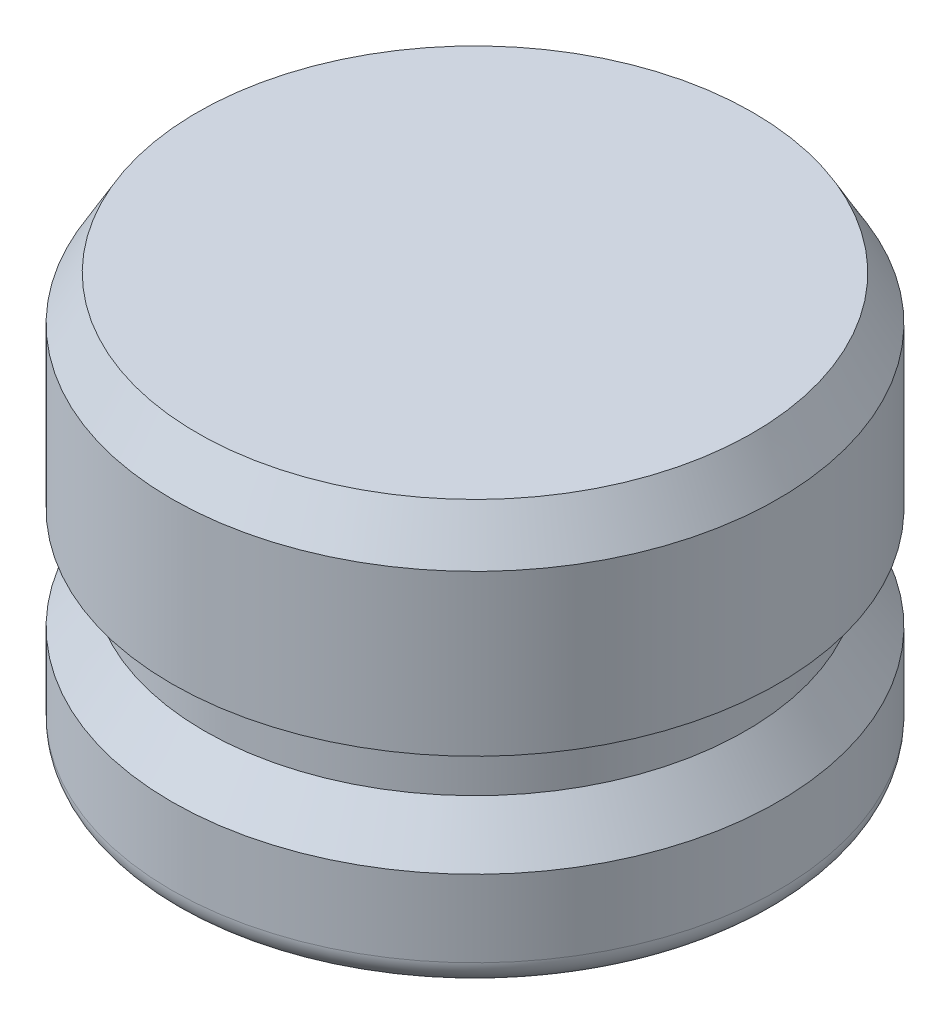
ISO-10303-21;
HEADER;
FILE_DESCRIPTION(('STEP AP214'),'2;1');
FILE_NAME('part.step','',(''),(''),'','','');
FILE_SCHEMA(('AUTOMOTIVE_DESIGN { 1 0 10303 214 1 1 1 1 }'));
ENDSEC;
DATA;
#1=APPLICATION_CONTEXT('core data for automotive mechanical design processes');
#2=APPLICATION_PROTOCOL_DEFINITION('international standard','automotive_design',2000,#1);
#3=PRODUCT_CONTEXT('',#1,'mechanical');
#4=PRODUCT('Part','Part','',(#3));
#5=PRODUCT_RELATED_PRODUCT_CATEGORY('part','',(#4));
#6=PRODUCT_DEFINITION_FORMATION('','',#4);
#7=PRODUCT_DEFINITION_CONTEXT('part definition',#1,'design');
#8=PRODUCT_DEFINITION('design','',#6,#7);
#9=PRODUCT_DEFINITION_SHAPE('','',#8);
#10=(LENGTH_UNIT() NAMED_UNIT(*) SI_UNIT(.MILLI.,.METRE.));
#11=(NAMED_UNIT(*) PLANE_ANGLE_UNIT() SI_UNIT($,.RADIAN.));
#12=(NAMED_UNIT(*) SI_UNIT($,.STERADIAN.) SOLID_ANGLE_UNIT());
#13=UNCERTAINTY_MEASURE_WITH_UNIT(LENGTH_MEASURE(1.E-05),#10,'distance_accuracy_value','');
#14=(GEOMETRIC_REPRESENTATION_CONTEXT(3) GLOBAL_UNCERTAINTY_ASSIGNED_CONTEXT((#13)) GLOBAL_UNIT_ASSIGNED_CONTEXT((#10,
#11,#12)) REPRESENTATION_CONTEXT('',''));
#15=CARTESIAN_POINT('',(0.,0.,0.));
#16=DIRECTION('',(0.,0.,1.));
#17=DIRECTION('',(1.,0.,0.));
#18=AXIS2_PLACEMENT_3D('',#15,#16,#17);
#19=CARTESIAN_POINT('',(0.,0.,0.));
#20=DIRECTION('',(0.,1.,0.));
#21=DIRECTION('',(0.,0.,1.));
#22=AXIS2_PLACEMENT_3D('',#19,#20,#21);
#23=PLANE('',#22);
#24=CARTESIAN_POINT('',(0.,0.,0.));
#25=DIRECTION('',(0.,1.,0.));
#26=DIRECTION('',(0.,0.,1.));
#27=AXIS2_PLACEMENT_3D('',#24,#25,#26);
#28=CIRCLE('',#27,8.62965);
#29=CARTESIAN_POINT('',(0.,0.,8.62965));
#30=VERTEX_POINT('',#29);
#31=EDGE_CURVE('E46',#30,#30,#28,.F.);
#32=ORIENTED_EDGE('',*,*,#31,.T.);
#33=EDGE_LOOP('',(#32));
#34=FACE_BOUND('',#33,.T.);
#35=ADVANCED_FACE('F31',(#34),#23,.F.);
#36=CARTESIAN_POINT('',(0.,0.,0.));
#37=DIRECTION('',(0.,-1.,0.));
#38=DIRECTION('',(0.,0.,-1.));
#39=AXIS2_PLACEMENT_3D('',#36,#37,#38);
#40=CYLINDRICAL_SURFACE('',#39,9.4234);
#41=CARTESIAN_POINT('',(0.,0.793749999999999,0.));
#42=DIRECTION('',(0.,1.,0.));
#43=DIRECTION('',(0.,0.,1.));
#44=AXIS2_PLACEMENT_3D('',#41,#42,#43);
#45=CIRCLE('',#44,9.4234);
#46=CARTESIAN_POINT('',(0.,0.793749999999999,9.4234));
#47=VERTEX_POINT('',#46);
#48=EDGE_CURVE('E42',#47,#47,#45,.T.);
#49=ORIENTED_EDGE('',*,*,#48,.T.);
#50=EDGE_LOOP('',(#49));
#51=FACE_BOUND('',#50,.T.);
#52=CARTESIAN_POINT('',(0.,3.175,0.));
#53=DIRECTION('',(0.,-1.,0.));
#54=DIRECTION('',(0.,0.,-1.));
#55=AXIS2_PLACEMENT_3D('',#52,#53,#54);
#56=CIRCLE('',#55,9.4234);
#57=CARTESIAN_POINT('',(0.,3.175,-9.4234));
#58=VERTEX_POINT('',#57);
#59=EDGE_CURVE('E51',#58,#58,#56,.T.);
#60=ORIENTED_EDGE('',*,*,#59,.T.);
#61=EDGE_LOOP('',(#60));
#62=FACE_BOUND('',#61,.T.);
#63=ADVANCED_FACE('F80',(#51,#62),#40,.T.);
#64=CARTESIAN_POINT('',(0.,4.572,0.));
#65=DIRECTION('',(0.,-1.,0.));
#66=DIRECTION('',(0.,0.,-1.));
#67=AXIS2_PLACEMENT_3D('',#64,#65,#66);
#68=CONICAL_SURFACE('',#67,8.4074,0.628796286415433);
#69=ORIENTED_EDGE('',*,*,#59,.F.);
#70=EDGE_LOOP('',(#69));
#71=FACE_BOUND('',#70,.T.);
#72=CARTESIAN_POINT('',(0.,4.572,0.));
#73=DIRECTION('',(0.,-1.,0.));
#74=DIRECTION('',(0.,0.,-1.));
#75=AXIS2_PLACEMENT_3D('',#72,#73,#74);
#76=CIRCLE('',#75,8.4074);
#77=CARTESIAN_POINT('',(0.,4.572,-8.4074));
#78=VERTEX_POINT('',#77);
#79=EDGE_CURVE('E54',#78,#78,#76,.T.);
#80=ORIENTED_EDGE('',*,*,#79,.T.);
#81=EDGE_LOOP('',(#80));
#82=FACE_BOUND('',#81,.T.);
#83=ADVANCED_FACE('F86',(#71,#82),#68,.T.);
#84=CARTESIAN_POINT('',(0.,0.,0.));
#85=DIRECTION('',(0.,-1.,0.));
#86=DIRECTION('',(0.,0.,-1.));
#87=AXIS2_PLACEMENT_3D('',#84,#85,#86);
#88=CYLINDRICAL_SURFACE('',#87,8.4074);
#89=ORIENTED_EDGE('',*,*,#79,.F.);
#90=EDGE_LOOP('',(#89));
#91=FACE_BOUND('',#90,.T.);
#92=CARTESIAN_POINT('',(0.,6.35,0.));
#93=DIRECTION('',(0.,-1.,0.));
#94=DIRECTION('',(0.,0.,-1.));
#95=AXIS2_PLACEMENT_3D('',#92,#93,#94);
#96=CIRCLE('',#95,8.4074);
#97=CARTESIAN_POINT('',(0.,6.35,-8.4074));
#98=VERTEX_POINT('',#97);
#99=EDGE_CURVE('E57',#98,#98,#96,.T.);
#100=ORIENTED_EDGE('',*,*,#99,.T.);
#101=EDGE_LOOP('',(#100));
#102=FACE_BOUND('',#101,.T.);
#103=ADVANCED_FACE('F76',(#91,#102),#88,.T.);
#104=CARTESIAN_POINT('',(-8.4074,6.35,0.));
#105=DIRECTION('',(0.,1.,0.));
#106=DIRECTION('',(0.,0.,1.));
#107=AXIS2_PLACEMENT_3D('',#104,#105,#106);
#108=PLANE('',#107);
#109=ORIENTED_EDGE('',*,*,#99,.F.);
#110=EDGE_LOOP('',(#109));
#111=FACE_BOUND('',#110,.T.);
#112=CARTESIAN_POINT('',(0.,6.35,0.));
#113=DIRECTION('',(0.,-1.,0.));
#114=DIRECTION('',(0.,0.,-1.));
#115=AXIS2_PLACEMENT_3D('',#112,#113,#114);
#116=CIRCLE('',#115,9.4234);
#117=CARTESIAN_POINT('',(0.,6.35,-9.4234));
#118=VERTEX_POINT('',#117);
#119=EDGE_CURVE('E60',#118,#118,#116,.T.);
#120=ORIENTED_EDGE('',*,*,#119,.T.);
#121=EDGE_LOOP('',(#120));
#122=FACE_BOUND('',#121,.T.);
#123=ADVANCED_FACE('F64',(#111,#122),#108,.F.);
#124=CARTESIAN_POINT('',(0.,0.,0.));
#125=DIRECTION('',(0.,-1.,0.));
#126=DIRECTION('',(0.,0.,-1.));
#127=AXIS2_PLACEMENT_3D('',#124,#125,#126);
#128=CYLINDRICAL_SURFACE('',#127,9.4234);
#129=CARTESIAN_POINT('',(0.,11.3251846714922,0.));
#130=DIRECTION('',(0.,-1.,0.));
#131=DIRECTION('',(0.,0.,-1.));
#132=AXIS2_PLACEMENT_3D('',#129,#130,#131);
#133=CIRCLE('',#132,9.4234);
#134=CARTESIAN_POINT('',(0.,11.3251846714922,-9.4234));
#135=VERTEX_POINT('',#134);
#136=EDGE_CURVE('E38',#135,#135,#133,.T.);
#137=ORIENTED_EDGE('',*,*,#136,.T.);
#138=EDGE_LOOP('',(#137));
#139=FACE_BOUND('',#138,.T.);
#140=ORIENTED_EDGE('',*,*,#119,.F.);
#141=EDGE_LOOP('',(#140));
#142=FACE_BOUND('',#141,.T.);
#143=ADVANCED_FACE('F66',(#139,#142),#128,.T.);
#144=CARTESIAN_POINT('',(-9.4234,12.7,0.));
#145=DIRECTION('',(0.,-1.,0.));
#146=DIRECTION('',(0.,0.,-1.));
#147=AXIS2_PLACEMENT_3D('',#144,#145,#146);
#148=PLANE('',#147);
#149=CARTESIAN_POINT('',(0.,12.7,0.));
#150=DIRECTION('',(0.,-1.,0.));
#151=DIRECTION('',(0.,0.,-1.));
#152=AXIS2_PLACEMENT_3D('',#149,#150,#151);
#153=CIRCLE('',#152,8.62965);
#154=CARTESIAN_POINT('',(0.,12.7,-8.62965));
#155=VERTEX_POINT('',#154);
#156=EDGE_CURVE('E10',#155,#155,#153,.F.);
#157=ORIENTED_EDGE('',*,*,#156,.T.);
#158=EDGE_LOOP('',(#157));
#159=FACE_BOUND('',#158,.T.);
#160=ADVANCED_FACE('F68',(#159),#148,.F.);
#161=CARTESIAN_POINT('',(0.,0.793749999999999,0.));
#162=DIRECTION('',(0.,1.,0.));
#163=DIRECTION('',(0.,0.,1.));
#164=AXIS2_PLACEMENT_3D('',#161,#162,#163);
#165=TOROIDAL_SURFACE('',#164,8.62965,0.79375);
#166=ORIENTED_EDGE('',*,*,#48,.F.);
#167=EDGE_LOOP('',(#166));
#168=FACE_BOUND('',#167,.T.);
#169=ORIENTED_EDGE('',*,*,#31,.F.);
#170=EDGE_LOOP('',(#169));
#171=FACE_BOUND('',#170,.T.);
#172=ADVANCED_FACE('F74',(#168,#171),#165,.T.);
#173=CARTESIAN_POINT('',(0.,11.3251846714922,0.));
#174=DIRECTION('',(0.,-1.,0.));
#175=DIRECTION('',(0.,0.,-1.));
#176=AXIS2_PLACEMENT_3D('',#173,#174,#175);
#177=CONICAL_SURFACE('',#176,9.4234,0.5235987755983);
#178=ORIENTED_EDGE('',*,*,#156,.F.);
#179=EDGE_LOOP('',(#178));
#180=FACE_BOUND('',#179,.T.);
#181=ORIENTED_EDGE('',*,*,#136,.F.);
#182=EDGE_LOOP('',(#181));
#183=FACE_BOUND('',#182,.T.);
#184=ADVANCED_FACE('F33',(#180,#183),#177,.T.);
#185=CLOSED_SHELL('',(#35,#63,#83,#103,#123,#143,#160,#172,#184));
#186=MANIFOLD_SOLID_BREP('B2',#185);
#187=ADVANCED_BREP_SHAPE_REPRESENTATION('',(#18,#186),#14);
#188=SHAPE_DEFINITION_REPRESENTATION(#9,#187);
ENDSEC;
END-ISO-10303-21;
